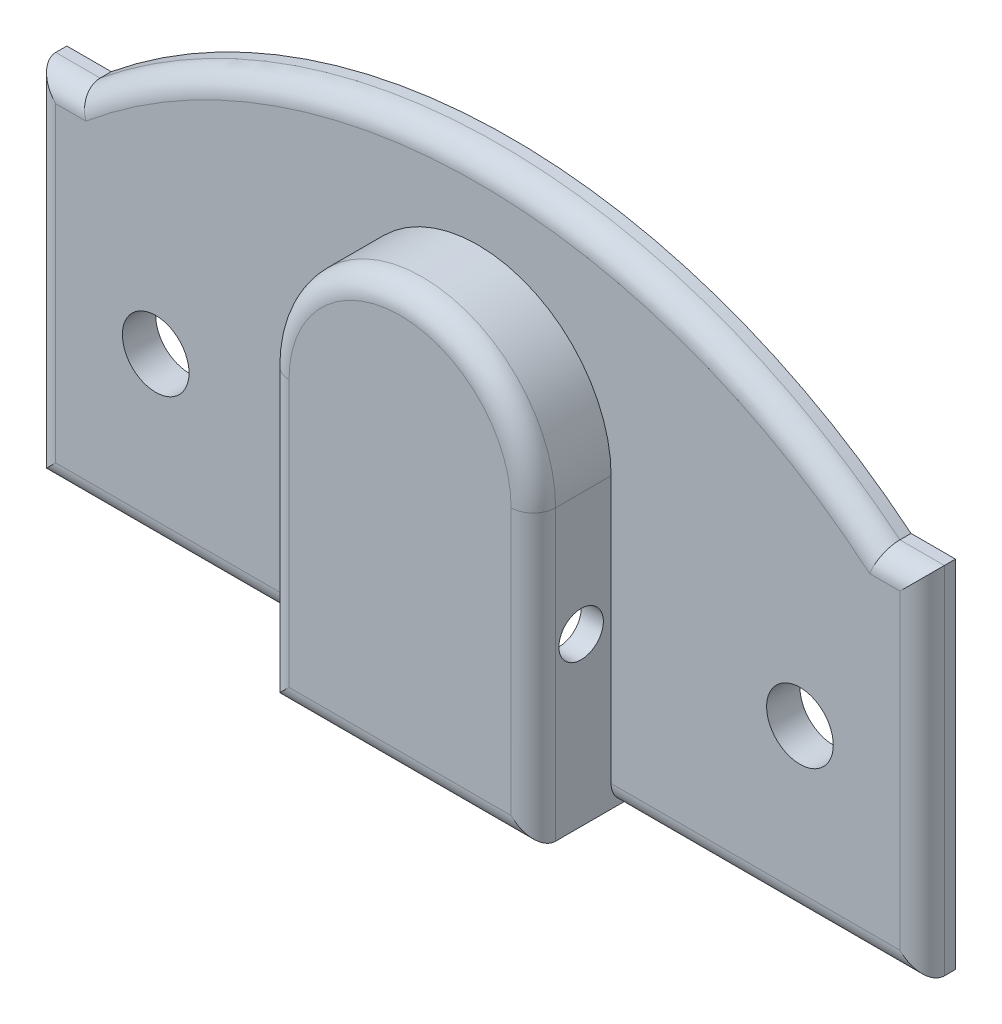
ISO-10303-21;
HEADER;
FILE_DESCRIPTION(('STEP AP214'),'2;1');
FILE_NAME('part.step','',(''),(''),'','','');
FILE_SCHEMA(('AUTOMOTIVE_DESIGN { 1 0 10303 214 1 1 1 1 }'));
ENDSEC;
DATA;
#1=APPLICATION_CONTEXT('core data for automotive mechanical design processes');
#2=APPLICATION_PROTOCOL_DEFINITION('international standard','automotive_design',2000,#1);
#3=PRODUCT_CONTEXT('',#1,'mechanical');
#4=PRODUCT('Part','Part','',(#3));
#5=PRODUCT_RELATED_PRODUCT_CATEGORY('part','',(#4));
#6=PRODUCT_DEFINITION_FORMATION('','',#4);
#7=PRODUCT_DEFINITION_CONTEXT('part definition',#1,'design');
#8=PRODUCT_DEFINITION('design','',#6,#7);
#9=PRODUCT_DEFINITION_SHAPE('','',#8);
#10=(LENGTH_UNIT() NAMED_UNIT(*) SI_UNIT(.MILLI.,.METRE.));
#11=(NAMED_UNIT(*) PLANE_ANGLE_UNIT() SI_UNIT($,.RADIAN.));
#12=(NAMED_UNIT(*) SI_UNIT($,.STERADIAN.) SOLID_ANGLE_UNIT());
#13=UNCERTAINTY_MEASURE_WITH_UNIT(LENGTH_MEASURE(1.E-05),#10,'distance_accuracy_value','');
#14=(GEOMETRIC_REPRESENTATION_CONTEXT(3) GLOBAL_UNCERTAINTY_ASSIGNED_CONTEXT((#13)) GLOBAL_UNIT_ASSIGNED_CONTEXT((#10,
#11,#12)) REPRESENTATION_CONTEXT('',''));
#15=CARTESIAN_POINT('',(0.,0.,0.));
#16=DIRECTION('',(0.,0.,1.));
#17=DIRECTION('',(1.,0.,0.));
#18=AXIS2_PLACEMENT_3D('',#15,#16,#17);
#19=CARTESIAN_POINT('',(0.,-6.07308128882335,0.));
#20=DIRECTION('',(0.,0.,-1.));
#21=DIRECTION('',(-1.,0.,0.));
#22=AXIS2_PLACEMENT_3D('',#19,#20,#21);
#23=PLANE('',#22);
#24=DIRECTION('',(1.,0.,0.));
#25=VECTOR('',#24,1.);
#26=CARTESIAN_POINT('',(0.,0.,0.));
#27=LINE('',#26,#25);
#28=CARTESIAN_POINT('',(5.,0.,0.));
#29=VERTEX_POINT('',#28);
#30=CARTESIAN_POINT('',(20.,0.,0.));
#31=VERTEX_POINT('',#30);
#32=EDGE_CURVE('E218',#29,#31,#27,.T.);
#33=ORIENTED_EDGE('',*,*,#32,.F.);
#34=DIRECTION('',(0.,1.,0.));
#35=VECTOR('',#34,1.);
#36=CARTESIAN_POINT('',(5.,0.,0.));
#37=LINE('',#36,#35);
#38=CARTESIAN_POINT('',(5.,12.,0.));
#39=VERTEX_POINT('',#38);
#40=EDGE_CURVE('E288',#29,#39,#37,.T.);
#41=ORIENTED_EDGE('',*,*,#40,.T.);
#42=CARTESIAN_POINT('',(0.,12.,0.));
#43=DIRECTION('',(0.,0.,1.));
#44=DIRECTION('',(1.,0.,0.));
#45=AXIS2_PLACEMENT_3D('',#42,#43,#44);
#46=CIRCLE('',#45,5.);
#47=CARTESIAN_POINT('',(-5.,12.,0.));
#48=VERTEX_POINT('',#47);
#49=EDGE_CURVE('E201',#39,#48,#46,.T.);
#50=ORIENTED_EDGE('',*,*,#49,.T.);
#51=DIRECTION('',(0.,1.,0.));
#52=VECTOR('',#51,1.);
#53=CARTESIAN_POINT('',(-5.,0.,0.));
#54=LINE('',#53,#52);
#55=CARTESIAN_POINT('',(-5.,0.,0.));
#56=VERTEX_POINT('',#55);
#57=EDGE_CURVE('E197',#56,#48,#54,.T.);
#58=ORIENTED_EDGE('',*,*,#57,.F.);
#59=CARTESIAN_POINT('',(-20.,0.,0.));
#60=VERTEX_POINT('',#59);
#61=EDGE_CURVE('E226',#60,#56,#27,.T.);
#62=ORIENTED_EDGE('',*,*,#61,.F.);
#63=DIRECTION('',(0.,-1.,0.));
#64=VECTOR('',#63,1.);
#65=CARTESIAN_POINT('',(-20.,16.,0.));
#66=LINE('',#65,#64);
#67=CARTESIAN_POINT('',(-20.,16.,0.));
#68=VERTEX_POINT('',#67);
#69=EDGE_CURVE('E241',#68,#60,#66,.T.);
#70=ORIENTED_EDGE('',*,*,#69,.F.);
#71=DIRECTION('',(-1.,0.,0.));
#72=VECTOR('',#71,1.);
#73=CARTESIAN_POINT('',(-20.,16.,0.));
#74=LINE('',#73,#72);
#75=CARTESIAN_POINT('',(-18.,16.,0.));
#76=VERTEX_POINT('',#75);
#77=EDGE_CURVE('E238',#76,#68,#74,.T.);
#78=ORIENTED_EDGE('',*,*,#77,.F.);
#79=CARTESIAN_POINT('',(0.,-6.07308128882335,0.));
#80=DIRECTION('',(0.,0.,1.));
#81=DIRECTION('',(-1.,0.,0.));
#82=AXIS2_PLACEMENT_3D('',#79,#80,#81);
#83=CIRCLE('',#82,28.4819402004674);
#84=CARTESIAN_POINT('',(18.,16.,0.));
#85=VERTEX_POINT('',#84);
#86=EDGE_CURVE('E235',#85,#76,#83,.T.);
#87=ORIENTED_EDGE('',*,*,#86,.F.);
#88=DIRECTION('',(-1.,0.,0.));
#89=VECTOR('',#88,1.);
#90=CARTESIAN_POINT('',(20.,16.,0.));
#91=LINE('',#90,#89);
#92=CARTESIAN_POINT('',(20.,16.,0.));
#93=VERTEX_POINT('',#92);
#94=EDGE_CURVE('E232',#93,#85,#91,.T.);
#95=ORIENTED_EDGE('',*,*,#94,.F.);
#96=DIRECTION('',(0.,1.,0.));
#97=VECTOR('',#96,1.);
#98=CARTESIAN_POINT('',(20.,0.,0.));
#99=LINE('',#98,#97);
#100=EDGE_CURVE('E229',#31,#93,#99,.T.);
#101=ORIENTED_EDGE('',*,*,#100,.F.);
#102=EDGE_LOOP('',(#33,#41,#50,#58,#62,#70,#78,#87,#95,#101));
#103=FACE_BOUND('',#102,.T.);
#104=CARTESIAN_POINT('',(-14.4995957691845,7.5,0.));
#105=DIRECTION('',(0.,0.,-1.));
#106=DIRECTION('',(-1.,0.,0.));
#107=AXIS2_PLACEMENT_3D('',#104,#105,#106);
#108=CIRCLE('',#107,1.5);
#109=CARTESIAN_POINT('',(-15.9995957691845,7.5,0.));
#110=VERTEX_POINT('',#109);
#111=EDGE_CURVE('E497',#110,#110,#108,.T.);
#112=ORIENTED_EDGE('',*,*,#111,.F.);
#113=EDGE_LOOP('',(#112));
#114=FACE_BOUND('',#113,.T.);
#115=CARTESIAN_POINT('',(14.4995957691845,7.5,0.));
#116=DIRECTION('',(0.,0.,-1.));
#117=DIRECTION('',(-1.,0.,0.));
#118=AXIS2_PLACEMENT_3D('',#115,#116,#117);
#119=CIRCLE('',#118,1.5);
#120=CARTESIAN_POINT('',(12.9995957691845,7.5,0.));
#121=VERTEX_POINT('',#120);
#122=EDGE_CURVE('E320',#121,#121,#119,.F.);
#123=ORIENTED_EDGE('',*,*,#122,.T.);
#124=EDGE_LOOP('',(#123));
#125=FACE_BOUND('',#124,.T.);
#126=ADVANCED_FACE('F38',(#103,#114,#125),#23,.T.);
#127=CARTESIAN_POINT('',(0.,-6.07308128882335,1.5));
#128=DIRECTION('',(0.,0.,-1.));
#129=DIRECTION('',(-1.,0.,0.));
#130=AXIS2_PLACEMENT_3D('',#127,#128,#129);
#131=PLANE('',#130);
#132=CARTESIAN_POINT('',(-14.4995957691845,7.5,1.5));
#133=DIRECTION('',(0.,0.,1.));
#134=DIRECTION('',(1.,0.,0.));
#135=AXIS2_PLACEMENT_3D('',#132,#133,#134);
#136=CIRCLE('',#135,1.5);
#137=CARTESIAN_POINT('',(-12.9995957691845,7.5,1.5));
#138=VERTEX_POINT('',#137);
#139=EDGE_CURVE('E501',#138,#138,#136,.T.);
#140=ORIENTED_EDGE('',*,*,#139,.F.);
#141=EDGE_LOOP('',(#140));
#142=FACE_BOUND('',#141,.T.);
#143=DIRECTION('',(0.,1.,0.));
#144=VECTOR('',#143,1.);
#145=CARTESIAN_POINT('',(6.,0.,1.5));
#146=LINE('',#145,#144);
#147=CARTESIAN_POINT('',(6.,1.,1.5));
#148=VERTEX_POINT('',#147);
#149=CARTESIAN_POINT('',(6.,13.,1.5));
#150=VERTEX_POINT('',#149);
#151=EDGE_CURVE('E213',#148,#150,#146,.T.);
#152=ORIENTED_EDGE('',*,*,#151,.F.);
#153=DIRECTION('',(1.,0.,0.));
#154=VECTOR('',#153,1.);
#155=CARTESIAN_POINT('',(0.,1.,1.5));
#156=LINE('',#155,#154);
#157=CARTESIAN_POINT('',(19.,1.,1.5));
#158=VERTEX_POINT('',#157);
#159=EDGE_CURVE('E300',#148,#158,#156,.T.);
#160=ORIENTED_EDGE('',*,*,#159,.T.);
#161=DIRECTION('',(0.,1.,0.));
#162=VECTOR('',#161,1.);
#163=CARTESIAN_POINT('',(19.,-6.07308128882335,1.5));
#164=LINE('',#163,#162);
#165=CARTESIAN_POINT('',(19.,15.,1.5));
#166=VERTEX_POINT('',#165);
#167=EDGE_CURVE('E298',#158,#166,#164,.T.);
#168=ORIENTED_EDGE('',*,*,#167,.T.);
#169=DIRECTION('',(-1.,0.,0.));
#170=VECTOR('',#169,1.);
#171=CARTESIAN_POINT('',(0.,15.,1.5));
#172=LINE('',#171,#170);
#173=CARTESIAN_POINT('',(17.6403594684664,15.,1.5));
#174=VERTEX_POINT('',#173);
#175=EDGE_CURVE('E296',#166,#174,#172,.T.);
#176=ORIENTED_EDGE('',*,*,#175,.T.);
#177=CARTESIAN_POINT('',(0.,-6.07308128882335,1.5));
#178=DIRECTION('',(0.,0.,-1.));
#179=DIRECTION('',(-1.,0.,0.));
#180=AXIS2_PLACEMENT_3D('',#177,#178,#179);
#181=CIRCLE('',#180,27.4819402004674);
#182=CARTESIAN_POINT('',(-17.6403594684664,15.,1.5));
#183=VERTEX_POINT('',#182);
#184=EDGE_CURVE('E292',#174,#183,#181,.F.);
#185=ORIENTED_EDGE('',*,*,#184,.T.);
#186=DIRECTION('',(-1.,0.,0.));
#187=VECTOR('',#186,1.);
#188=CARTESIAN_POINT('',(0.,15.,1.5));
#189=LINE('',#188,#187);
#190=CARTESIAN_POINT('',(-19.,15.,1.5));
#191=VERTEX_POINT('',#190);
#192=EDGE_CURVE('E290',#183,#191,#189,.T.);
#193=ORIENTED_EDGE('',*,*,#192,.T.);
#194=DIRECTION('',(0.,-1.,0.));
#195=VECTOR('',#194,1.);
#196=CARTESIAN_POINT('',(-19.,-6.07308128882335,1.5));
#197=LINE('',#196,#195);
#198=CARTESIAN_POINT('',(-19.,1.,1.5));
#199=VERTEX_POINT('',#198);
#200=EDGE_CURVE('E276',#191,#199,#197,.T.);
#201=ORIENTED_EDGE('',*,*,#200,.T.);
#202=DIRECTION('',(1.,0.,0.));
#203=VECTOR('',#202,1.);
#204=CARTESIAN_POINT('',(0.,1.,1.5));
#205=LINE('',#204,#203);
#206=CARTESIAN_POINT('',(-6.,1.,1.5));
#207=VERTEX_POINT('',#206);
#208=EDGE_CURVE('E294',#199,#207,#205,.T.);
#209=ORIENTED_EDGE('',*,*,#208,.T.);
#210=DIRECTION('',(0.,1.,0.));
#211=VECTOR('',#210,1.);
#212=CARTESIAN_POINT('',(-6.,0.,1.5));
#213=LINE('',#212,#211);
#214=CARTESIAN_POINT('',(-6.,13.,1.5));
#215=VERTEX_POINT('',#214);
#216=EDGE_CURVE('E202',#207,#215,#213,.T.);
#217=ORIENTED_EDGE('',*,*,#216,.T.);
#218=CARTESIAN_POINT('',(0.,13.,1.5));
#219=DIRECTION('',(0.,0.,-1.));
#220=DIRECTION('',(-1.,0.,0.));
#221=AXIS2_PLACEMENT_3D('',#218,#219,#220);
#222=CIRCLE('',#221,6.);
#223=EDGE_CURVE('E205',#215,#150,#222,.T.);
#224=ORIENTED_EDGE('',*,*,#223,.T.);
#225=EDGE_LOOP('',(#152,#160,#168,#176,#185,#193,#201,#209,#217,#224));
#226=FACE_BOUND('',#225,.T.);
#227=CARTESIAN_POINT('',(14.4995957691845,7.5,1.5));
#228=DIRECTION('',(0.,0.,1.));
#229=DIRECTION('',(1.,0.,0.));
#230=AXIS2_PLACEMENT_3D('',#227,#228,#229);
#231=CIRCLE('',#230,1.5);
#232=CARTESIAN_POINT('',(15.9995957691845,7.5,1.5));
#233=VERTEX_POINT('',#232);
#234=EDGE_CURVE('E500',#233,#233,#231,.F.);
#235=ORIENTED_EDGE('',*,*,#234,.T.);
#236=EDGE_LOOP('',(#235));
#237=FACE_BOUND('',#236,.T.);
#238=ADVANCED_FACE('F361',(#142,#226,#237),#131,.F.);
#239=CARTESIAN_POINT('',(0.,0.,1.5));
#240=DIRECTION('',(0.,1.,0.));
#241=DIRECTION('',(0.,0.,1.));
#242=AXIS2_PLACEMENT_3D('',#239,#240,#241);
#243=PLANE('',#242);
#244=DIRECTION('',(0.,0.,-1.));
#245=VECTOR('',#244,1.);
#246=CARTESIAN_POINT('',(20.,0.,1.5));
#247=LINE('',#246,#245);
#248=CARTESIAN_POINT('',(20.,0.,0.5));
#249=VERTEX_POINT('',#248);
#250=EDGE_CURVE('E254',#249,#31,#247,.T.);
#251=ORIENTED_EDGE('',*,*,#250,.F.);
#252=DIRECTION('',(1.,0.,0.));
#253=VECTOR('',#252,1.);
#254=CARTESIAN_POINT('',(0.,0.,0.5));
#255=LINE('',#254,#253);
#256=CARTESIAN_POINT('',(6.,0.,0.5));
#257=VERTEX_POINT('',#256);
#258=EDGE_CURVE('E303',#249,#257,#255,.F.);
#259=ORIENTED_EDGE('',*,*,#258,.T.);
#260=DIRECTION('',(0.,0.,-1.));
#261=VECTOR('',#260,1.);
#262=CARTESIAN_POINT('',(6.,0.,5.));
#263=LINE('',#262,#261);
#264=CARTESIAN_POINT('',(6.,0.,4.));
#265=VERTEX_POINT('',#264);
#266=EDGE_CURVE('E219',#265,#257,#263,.T.);
#267=ORIENTED_EDGE('',*,*,#266,.F.);
#268=DIRECTION('',(1.,0.,0.));
#269=VECTOR('',#268,1.);
#270=CARTESIAN_POINT('',(0.,0.,4.));
#271=LINE('',#270,#269);
#272=CARTESIAN_POINT('',(5.,0.,4.));
#273=VERTEX_POINT('',#272);
#274=EDGE_CURVE('E272',#265,#273,#271,.F.);
#275=ORIENTED_EDGE('',*,*,#274,.T.);
#276=DIRECTION('',(0.,0.,-1.));
#277=VECTOR('',#276,1.);
#278=CARTESIAN_POINT('',(5.,0.,4.));
#279=LINE('',#278,#277);
#280=EDGE_CURVE('E196',#273,#29,#279,.T.);
#281=ORIENTED_EDGE('',*,*,#280,.T.);
#282=ORIENTED_EDGE('',*,*,#32,.T.);
#283=EDGE_LOOP('',(#251,#259,#267,#275,#281,#282));
#284=FACE_BOUND('',#283,.T.);
#285=ADVANCED_FACE('F367',(#284),#243,.F.);
#286=DIRECTION('',(0.,0.,-1.));
#287=VECTOR('',#286,1.);
#288=CARTESIAN_POINT('',(-6.,0.,5.));
#289=LINE('',#288,#287);
#290=CARTESIAN_POINT('',(-6.,0.,4.));
#291=VERTEX_POINT('',#290);
#292=CARTESIAN_POINT('',(-6.,0.,0.5));
#293=VERTEX_POINT('',#292);
#294=EDGE_CURVE('E216',#291,#293,#289,.T.);
#295=ORIENTED_EDGE('',*,*,#294,.T.);
#296=DIRECTION('',(1.,0.,0.));
#297=VECTOR('',#296,1.);
#298=CARTESIAN_POINT('',(0.,0.,0.5));
#299=LINE('',#298,#297);
#300=CARTESIAN_POINT('',(-20.,0.,0.5));
#301=VERTEX_POINT('',#300);
#302=EDGE_CURVE('E310',#293,#301,#299,.F.);
#303=ORIENTED_EDGE('',*,*,#302,.T.);
#304=DIRECTION('',(0.,0.,-1.));
#305=VECTOR('',#304,1.);
#306=CARTESIAN_POINT('',(-20.,0.,1.5));
#307=LINE('',#306,#305);
#308=EDGE_CURVE('E244',#301,#60,#307,.T.);
#309=ORIENTED_EDGE('',*,*,#308,.T.);
#310=ORIENTED_EDGE('',*,*,#61,.T.);
#311=DIRECTION('',(0.,0.,-1.));
#312=VECTOR('',#311,1.);
#313=CARTESIAN_POINT('',(-5.,0.,4.));
#314=LINE('',#313,#312);
#315=CARTESIAN_POINT('',(-5.,0.,4.));
#316=VERTEX_POINT('',#315);
#317=EDGE_CURVE('E207',#316,#56,#314,.T.);
#318=ORIENTED_EDGE('',*,*,#317,.F.);
#319=DIRECTION('',(1.,0.,0.));
#320=VECTOR('',#319,1.);
#321=CARTESIAN_POINT('',(0.,0.,4.));
#322=LINE('',#321,#320);
#323=EDGE_CURVE('E270',#316,#291,#322,.F.);
#324=ORIENTED_EDGE('',*,*,#323,.T.);
#325=EDGE_LOOP('',(#295,#303,#309,#310,#318,#324));
#326=FACE_BOUND('',#325,.T.);
#327=ADVANCED_FACE('F392',(#326),#243,.F.);
#328=CARTESIAN_POINT('',(20.,0.,1.5));
#329=DIRECTION('',(-1.,0.,0.));
#330=DIRECTION('',(0.,0.,1.));
#331=AXIS2_PLACEMENT_3D('',#328,#329,#330);
#332=PLANE('',#331);
#333=DIRECTION('',(0.,0.,-1.));
#334=VECTOR('',#333,1.);
#335=CARTESIAN_POINT('',(20.,16.,1.5));
#336=LINE('',#335,#334);
#337=CARTESIAN_POINT('',(20.,16.,0.5));
#338=VERTEX_POINT('',#337);
#339=EDGE_CURVE('E252',#338,#93,#336,.T.);
#340=ORIENTED_EDGE('',*,*,#339,.F.);
#341=DIRECTION('',(0.,1.,0.));
#342=VECTOR('',#341,1.);
#343=CARTESIAN_POINT('',(20.,0.,0.5));
#344=LINE('',#343,#342);
#345=EDGE_CURVE('E306',#338,#249,#344,.F.);
#346=ORIENTED_EDGE('',*,*,#345,.T.);
#347=ORIENTED_EDGE('',*,*,#250,.T.);
#348=ORIENTED_EDGE('',*,*,#100,.T.);
#349=EDGE_LOOP('',(#340,#346,#347,#348));
#350=FACE_BOUND('',#349,.T.);
#351=ADVANCED_FACE('F388',(#350),#332,.F.);
#352=CARTESIAN_POINT('',(20.,16.,1.5));
#353=DIRECTION('',(0.,-1.,0.));
#354=DIRECTION('',(1.,0.,0.));
#355=AXIS2_PLACEMENT_3D('',#352,#353,#354);
#356=PLANE('',#355);
#357=DIRECTION('',(0.,0.,-1.));
#358=VECTOR('',#357,1.);
#359=CARTESIAN_POINT('',(18.,16.,1.5));
#360=LINE('',#359,#358);
#361=CARTESIAN_POINT('',(18.,16.,0.5));
#362=VERTEX_POINT('',#361);
#363=EDGE_CURVE('E250',#362,#85,#360,.T.);
#364=ORIENTED_EDGE('',*,*,#363,.F.);
#365=DIRECTION('',(-1.,0.,0.));
#366=VECTOR('',#365,1.);
#367=CARTESIAN_POINT('',(20.,16.,0.5));
#368=LINE('',#367,#366);
#369=EDGE_CURVE('E308',#362,#338,#368,.F.);
#370=ORIENTED_EDGE('',*,*,#369,.T.);
#371=ORIENTED_EDGE('',*,*,#339,.T.);
#372=ORIENTED_EDGE('',*,*,#94,.T.);
#373=EDGE_LOOP('',(#364,#370,#371,#372));
#374=FACE_BOUND('',#373,.T.);
#375=ADVANCED_FACE('F384',(#374),#356,.F.);
#376=CARTESIAN_POINT('',(0.,-6.07308128882335,1.5));
#377=DIRECTION('',(0.,0.,-1.));
#378=DIRECTION('',(-1.,0.,0.));
#379=AXIS2_PLACEMENT_3D('',#376,#377,#378);
#380=CYLINDRICAL_SURFACE('',#379,28.4819402004674);
#381=DIRECTION('',(0.,0.,-1.));
#382=VECTOR('',#381,1.);
#383=CARTESIAN_POINT('',(-18.,16.,1.5));
#384=LINE('',#383,#382);
#385=CARTESIAN_POINT('',(-18.,16.,0.5));
#386=VERTEX_POINT('',#385);
#387=EDGE_CURVE('E248',#386,#76,#384,.T.);
#388=ORIENTED_EDGE('',*,*,#387,.F.);
#389=CARTESIAN_POINT('',(0.,-6.07308128882335,0.5));
#390=DIRECTION('',(0.,0.,-1.));
#391=DIRECTION('',(-1.,0.,0.));
#392=AXIS2_PLACEMENT_3D('',#389,#390,#391);
#393=CIRCLE('',#392,28.4819402004674);
#394=EDGE_CURVE('E312',#386,#362,#393,.T.);
#395=ORIENTED_EDGE('',*,*,#394,.T.);
#396=ORIENTED_EDGE('',*,*,#363,.T.);
#397=ORIENTED_EDGE('',*,*,#86,.T.);
#398=EDGE_LOOP('',(#388,#395,#396,#397));
#399=FACE_BOUND('',#398,.T.);
#400=ADVANCED_FACE('F381',(#399),#380,.T.);
#401=CARTESIAN_POINT('',(-20.,16.,1.5));
#402=DIRECTION('',(0.,-1.,0.));
#403=DIRECTION('',(0.,0.,-1.));
#404=AXIS2_PLACEMENT_3D('',#401,#402,#403);
#405=PLANE('',#404);
#406=DIRECTION('',(0.,0.,-1.));
#407=VECTOR('',#406,1.);
#408=CARTESIAN_POINT('',(-20.,16.,1.5));
#409=LINE('',#408,#407);
#410=CARTESIAN_POINT('',(-20.,16.,0.5));
#411=VERTEX_POINT('',#410);
#412=EDGE_CURVE('E246',#411,#68,#409,.T.);
#413=ORIENTED_EDGE('',*,*,#412,.F.);
#414=DIRECTION('',(-1.,0.,0.));
#415=VECTOR('',#414,1.);
#416=CARTESIAN_POINT('',(-20.,16.,0.5));
#417=LINE('',#416,#415);
#418=EDGE_CURVE('E62',#411,#386,#417,.F.);
#419=ORIENTED_EDGE('',*,*,#418,.T.);
#420=ORIENTED_EDGE('',*,*,#387,.T.);
#421=ORIENTED_EDGE('',*,*,#77,.T.);
#422=EDGE_LOOP('',(#413,#419,#420,#421));
#423=FACE_BOUND('',#422,.T.);
#424=ADVANCED_FACE('F378',(#423),#405,.F.);
#425=CARTESIAN_POINT('',(-20.,16.,1.5));
#426=DIRECTION('',(1.,0.,0.));
#427=DIRECTION('',(0.,1.,0.));
#428=AXIS2_PLACEMENT_3D('',#425,#426,#427);
#429=PLANE('',#428);
#430=ORIENTED_EDGE('',*,*,#308,.F.);
#431=DIRECTION('',(0.,-1.,0.));
#432=VECTOR('',#431,1.);
#433=CARTESIAN_POINT('',(-20.,16.,0.5));
#434=LINE('',#433,#432);
#435=EDGE_CURVE('E55',#301,#411,#434,.F.);
#436=ORIENTED_EDGE('',*,*,#435,.T.);
#437=ORIENTED_EDGE('',*,*,#412,.T.);
#438=ORIENTED_EDGE('',*,*,#69,.T.);
#439=EDGE_LOOP('',(#430,#436,#437,#438));
#440=FACE_BOUND('',#439,.T.);
#441=ADVANCED_FACE('F374',(#440),#429,.F.);
#442=CARTESIAN_POINT('',(-6.,0.,5.));
#443=DIRECTION('',(-1.,0.,0.));
#444=DIRECTION('',(0.,0.,1.));
#445=AXIS2_PLACEMENT_3D('',#442,#443,#444);
#446=PLANE('',#445);
#447=CARTESIAN_POINT('',(-6.,7.5,2.85));
#448=DIRECTION('',(-1.,0.,0.));
#449=DIRECTION('',(0.,0.,1.));
#450=AXIS2_PLACEMENT_3D('',#447,#448,#449);
#451=CIRCLE('',#450,1.);
#452=CARTESIAN_POINT('',(-6.,7.5,3.85));
#453=VERTEX_POINT('',#452);
#454=EDGE_CURVE('E512',#453,#453,#451,.T.);
#455=ORIENTED_EDGE('',*,*,#454,.F.);
#456=EDGE_LOOP('',(#455));
#457=FACE_BOUND('',#456,.T.);
#458=ORIENTED_EDGE('',*,*,#294,.F.);
#459=DIRECTION('',(0.,1.,0.));
#460=VECTOR('',#459,1.);
#461=CARTESIAN_POINT('',(-6.,13.,4.));
#462=LINE('',#461,#460);
#463=CARTESIAN_POINT('',(-6.,13.,4.));
#464=VERTEX_POINT('',#463);
#465=EDGE_CURVE('E274',#291,#464,#462,.T.);
#466=ORIENTED_EDGE('',*,*,#465,.T.);
#467=DIRECTION('',(0.,0.,-1.));
#468=VECTOR('',#467,1.);
#469=CARTESIAN_POINT('',(-6.,13.,5.));
#470=LINE('',#469,#468);
#471=EDGE_CURVE('E215',#464,#215,#470,.T.);
#472=ORIENTED_EDGE('',*,*,#471,.T.);
#473=ORIENTED_EDGE('',*,*,#216,.F.);
#474=CARTESIAN_POINT('',(-6.,1.,0.5));
#475=DIRECTION('',(-1.,0.,0.));
#476=DIRECTION('',(0.,0.,1.));
#477=AXIS2_PLACEMENT_3D('',#474,#475,#476);
#478=CIRCLE('',#477,1.);
#479=EDGE_CURVE('E11',#207,#293,#478,.F.);
#480=ORIENTED_EDGE('',*,*,#479,.T.);
#481=EDGE_LOOP('',(#458,#466,#472,#473,#480));
#482=FACE_BOUND('',#481,.T.);
#483=ADVANCED_FACE('F377',(#457,#482),#446,.T.);
#484=CARTESIAN_POINT('',(6.,0.,5.));
#485=DIRECTION('',(-1.,0.,0.));
#486=DIRECTION('',(0.,0.,1.));
#487=AXIS2_PLACEMENT_3D('',#484,#485,#486);
#488=PLANE('',#487);
#489=CARTESIAN_POINT('',(6.,7.5,2.85));
#490=DIRECTION('',(-1.,0.,0.));
#491=DIRECTION('',(0.,0.,1.));
#492=AXIS2_PLACEMENT_3D('',#489,#490,#491);
#493=CIRCLE('',#492,1.);
#494=CARTESIAN_POINT('',(6.,7.5,3.85));
#495=VERTEX_POINT('',#494);
#496=EDGE_CURVE('E504',#495,#495,#493,.T.);
#497=ORIENTED_EDGE('',*,*,#496,.T.);
#498=EDGE_LOOP('',(#497));
#499=FACE_BOUND('',#498,.T.);
#500=DIRECTION('',(0.,0.,-1.));
#501=VECTOR('',#500,1.);
#502=CARTESIAN_POINT('',(6.,13.,5.));
#503=LINE('',#502,#501);
#504=CARTESIAN_POINT('',(6.,13.,4.));
#505=VERTEX_POINT('',#504);
#506=EDGE_CURVE('E221',#505,#150,#503,.T.);
#507=ORIENTED_EDGE('',*,*,#506,.F.);
#508=DIRECTION('',(0.,1.,0.));
#509=VECTOR('',#508,1.);
#510=CARTESIAN_POINT('',(6.,0.,4.));
#511=LINE('',#510,#509);
#512=EDGE_CURVE('E268',#505,#265,#511,.F.);
#513=ORIENTED_EDGE('',*,*,#512,.T.);
#514=ORIENTED_EDGE('',*,*,#266,.T.);
#515=CARTESIAN_POINT('',(6.,1.,0.5));
#516=DIRECTION('',(-1.,0.,0.));
#517=DIRECTION('',(0.,0.,1.));
#518=AXIS2_PLACEMENT_3D('',#515,#516,#517);
#519=CIRCLE('',#518,1.);
#520=EDGE_CURVE('E47',#257,#148,#519,.T.);
#521=ORIENTED_EDGE('',*,*,#520,.T.);
#522=ORIENTED_EDGE('',*,*,#151,.T.);
#523=EDGE_LOOP('',(#507,#513,#514,#521,#522));
#524=FACE_BOUND('',#523,.T.);
#525=ADVANCED_FACE('F482',(#499,#524),#488,.F.);
#526=CARTESIAN_POINT('',(0.,13.,5.));
#527=DIRECTION('',(0.,0.,-1.));
#528=DIRECTION('',(-1.,0.,0.));
#529=AXIS2_PLACEMENT_3D('',#526,#527,#528);
#530=CYLINDRICAL_SURFACE('',#529,6.);
#531=ORIENTED_EDGE('',*,*,#471,.F.);
#532=CARTESIAN_POINT('',(0.,13.,4.));
#533=DIRECTION('',(0.,0.,-1.));
#534=DIRECTION('',(-1.,0.,0.));
#535=AXIS2_PLACEMENT_3D('',#532,#533,#534);
#536=CIRCLE('',#535,6.);
#537=EDGE_CURVE('E256',#464,#505,#536,.T.);
#538=ORIENTED_EDGE('',*,*,#537,.T.);
#539=ORIENTED_EDGE('',*,*,#506,.T.);
#540=ORIENTED_EDGE('',*,*,#223,.F.);
#541=EDGE_LOOP('',(#531,#538,#539,#540));
#542=FACE_BOUND('',#541,.T.);
#543=ADVANCED_FACE('F452',(#542),#530,.T.);
#544=CARTESIAN_POINT('',(0.,13.,5.));
#545=DIRECTION('',(0.,0.,-1.));
#546=DIRECTION('',(-1.,0.,0.));
#547=AXIS2_PLACEMENT_3D('',#544,#545,#546);
#548=PLANE('',#547);
#549=DIRECTION('',(0.,1.,0.));
#550=VECTOR('',#549,1.);
#551=CARTESIAN_POINT('',(5.,13.,5.));
#552=LINE('',#551,#550);
#553=CARTESIAN_POINT('',(5.,0.999999999999999,5.));
#554=VERTEX_POINT('',#553);
#555=CARTESIAN_POINT('',(5.,13.,5.));
#556=VERTEX_POINT('',#555);
#557=EDGE_CURVE('E263',#554,#556,#552,.T.);
#558=ORIENTED_EDGE('',*,*,#557,.T.);
#559=CARTESIAN_POINT('',(0.,13.,5.));
#560=DIRECTION('',(0.,0.,-1.));
#561=DIRECTION('',(-1.,0.,0.));
#562=AXIS2_PLACEMENT_3D('',#559,#560,#561);
#563=CIRCLE('',#562,5.);
#564=CARTESIAN_POINT('',(-5.,13.,5.));
#565=VERTEX_POINT('',#564);
#566=EDGE_CURVE('E265',#556,#565,#563,.F.);
#567=ORIENTED_EDGE('',*,*,#566,.T.);
#568=DIRECTION('',(0.,1.,0.));
#569=VECTOR('',#568,1.);
#570=CARTESIAN_POINT('',(-5.,0.,5.));
#571=LINE('',#570,#569);
#572=CARTESIAN_POINT('',(-5.,0.999999999999999,5.));
#573=VERTEX_POINT('',#572);
#574=EDGE_CURVE('E259',#565,#573,#571,.F.);
#575=ORIENTED_EDGE('',*,*,#574,.T.);
#576=DIRECTION('',(1.,0.,0.));
#577=VECTOR('',#576,1.);
#578=CARTESIAN_POINT('',(0.,0.999999999999999,5.));
#579=LINE('',#578,#577);
#580=EDGE_CURVE('E261',#573,#554,#579,.T.);
#581=ORIENTED_EDGE('',*,*,#580,.T.);
#582=EDGE_LOOP('',(#558,#567,#575,#581));
#583=FACE_BOUND('',#582,.T.);
#584=ADVANCED_FACE('F544',(#583),#548,.F.);
#585=CARTESIAN_POINT('',(5.,0.,4.));
#586=DIRECTION('',(-1.,0.,0.));
#587=DIRECTION('',(0.,0.,1.));
#588=AXIS2_PLACEMENT_3D('',#585,#586,#587);
#589=PLANE('',#588);
#590=CARTESIAN_POINT('',(5.,7.5,2.85));
#591=DIRECTION('',(-1.,0.,0.));
#592=DIRECTION('',(0.,0.,1.));
#593=AXIS2_PLACEMENT_3D('',#590,#591,#592);
#594=CIRCLE('',#593,1.);
#595=CARTESIAN_POINT('',(5.,7.5,3.85));
#596=VERTEX_POINT('',#595);
#597=EDGE_CURVE('E509',#596,#596,#594,.T.);
#598=ORIENTED_EDGE('',*,*,#597,.F.);
#599=EDGE_LOOP('',(#598));
#600=FACE_BOUND('',#599,.T.);
#601=ORIENTED_EDGE('',*,*,#40,.F.);
#602=ORIENTED_EDGE('',*,*,#280,.F.);
#603=DIRECTION('',(0.,1.,0.));
#604=VECTOR('',#603,1.);
#605=CARTESIAN_POINT('',(5.,0.,4.));
#606=LINE('',#605,#604);
#607=CARTESIAN_POINT('',(5.,12.,4.));
#608=VERTEX_POINT('',#607);
#609=EDGE_CURVE('E182',#273,#608,#606,.T.);
#610=ORIENTED_EDGE('',*,*,#609,.T.);
#611=DIRECTION('',(0.,0.,-1.));
#612=VECTOR('',#611,1.);
#613=CARTESIAN_POINT('',(5.,12.,4.));
#614=LINE('',#613,#612);
#615=EDGE_CURVE('E193',#608,#39,#614,.T.);
#616=ORIENTED_EDGE('',*,*,#615,.T.);
#617=EDGE_LOOP('',(#601,#602,#610,#616));
#618=FACE_BOUND('',#617,.T.);
#619=ADVANCED_FACE('F192',(#600,#618),#589,.T.);
#620=CARTESIAN_POINT('',(0.,12.,4.));
#621=DIRECTION('',(0.,0.,-1.));
#622=DIRECTION('',(-1.,0.,0.));
#623=AXIS2_PLACEMENT_3D('',#620,#621,#622);
#624=CYLINDRICAL_SURFACE('',#623,5.);
#625=ORIENTED_EDGE('',*,*,#49,.F.);
#626=ORIENTED_EDGE('',*,*,#615,.F.);
#627=CARTESIAN_POINT('',(0.,12.,4.));
#628=DIRECTION('',(0.,0.,1.));
#629=DIRECTION('',(1.,0.,0.));
#630=AXIS2_PLACEMENT_3D('',#627,#628,#629);
#631=CIRCLE('',#630,5.);
#632=CARTESIAN_POINT('',(-5.,12.,4.));
#633=VERTEX_POINT('',#632);
#634=EDGE_CURVE('E178',#608,#633,#631,.T.);
#635=ORIENTED_EDGE('',*,*,#634,.T.);
#636=DIRECTION('',(0.,0.,-1.));
#637=VECTOR('',#636,1.);
#638=CARTESIAN_POINT('',(-5.,12.,4.));
#639=LINE('',#638,#637);
#640=EDGE_CURVE('E203',#633,#48,#639,.T.);
#641=ORIENTED_EDGE('',*,*,#640,.T.);
#642=EDGE_LOOP('',(#625,#626,#635,#641));
#643=FACE_BOUND('',#642,.T.);
#644=ADVANCED_FACE('F199',(#643),#624,.F.);
#645=CARTESIAN_POINT('',(-5.,0.,4.));
#646=DIRECTION('',(-1.,0.,0.));
#647=DIRECTION('',(0.,0.,1.));
#648=AXIS2_PLACEMENT_3D('',#645,#646,#647);
#649=PLANE('',#648);
#650=CARTESIAN_POINT('',(-5.,7.5,2.85));
#651=DIRECTION('',(-1.,0.,0.));
#652=DIRECTION('',(0.,0.,1.));
#653=AXIS2_PLACEMENT_3D('',#650,#651,#652);
#654=CIRCLE('',#653,1.);
#655=CARTESIAN_POINT('',(-5.,7.5,3.85));
#656=VERTEX_POINT('',#655);
#657=EDGE_CURVE('E42',#656,#656,#654,.T.);
#658=ORIENTED_EDGE('',*,*,#657,.T.);
#659=EDGE_LOOP('',(#658));
#660=FACE_BOUND('',#659,.T.);
#661=ORIENTED_EDGE('',*,*,#57,.T.);
#662=ORIENTED_EDGE('',*,*,#640,.F.);
#663=DIRECTION('',(0.,1.,0.));
#664=VECTOR('',#663,1.);
#665=CARTESIAN_POINT('',(-5.,0.,4.));
#666=LINE('',#665,#664);
#667=EDGE_CURVE('E184',#316,#633,#666,.T.);
#668=ORIENTED_EDGE('',*,*,#667,.F.);
#669=ORIENTED_EDGE('',*,*,#317,.T.);
#670=EDGE_LOOP('',(#661,#662,#668,#669));
#671=FACE_BOUND('',#670,.T.);
#672=ADVANCED_FACE('F493',(#660,#671),#649,.F.);
#673=CARTESIAN_POINT('',(0.,12.,4.));
#674=DIRECTION('',(0.,0.,1.));
#675=DIRECTION('',(1.,0.,0.));
#676=AXIS2_PLACEMENT_3D('',#673,#674,#675);
#677=PLANE('',#676);
#678=ORIENTED_EDGE('',*,*,#609,.F.);
#679=DIRECTION('',(-1.,0.,0.));
#680=VECTOR('',#679,1.);
#681=CARTESIAN_POINT('',(0.,0.,4.));
#682=LINE('',#681,#680);
#683=EDGE_CURVE('E484',#273,#316,#682,.T.);
#684=ORIENTED_EDGE('',*,*,#683,.T.);
#685=ORIENTED_EDGE('',*,*,#667,.T.);
#686=ORIENTED_EDGE('',*,*,#634,.F.);
#687=EDGE_LOOP('',(#678,#684,#685,#686));
#688=FACE_BOUND('',#687,.T.);
#689=ADVANCED_FACE('F180',(#688),#677,.F.);
#690=CARTESIAN_POINT('',(0.,0.999999999999999,4.));
#691=DIRECTION('',(1.,0.,0.));
#692=DIRECTION('',(0.,0.,-1.));
#693=AXIS2_PLACEMENT_3D('',#690,#691,#692);
#694=CYLINDRICAL_SURFACE('',#693,1.);
#695=CARTESIAN_POINT('',(5.,0.999999999999999,4.));
#696=DIRECTION('',(0.707106781186547,0.707106781186547,0.));
#697=DIRECTION('',(0.707106781186547,-0.707106781186547,0.));
#698=AXIS2_PLACEMENT_3D('',#695,#696,#697);
#699=ELLIPSE('',#698,1.41421356237309,1.);
#700=EDGE_CURVE('E282',#554,#265,#699,.T.);
#701=ORIENTED_EDGE('',*,*,#700,.F.);
#702=ORIENTED_EDGE('',*,*,#580,.F.);
#703=CARTESIAN_POINT('',(-5.,0.999999999999999,4.));
#704=DIRECTION('',(0.707106781186547,-0.707106781186547,0.));
#705=DIRECTION('',(-0.707106781186547,-0.707106781186547,0.));
#706=AXIS2_PLACEMENT_3D('',#703,#704,#705);
#707=ELLIPSE('',#706,1.41421356237309,1.);
#708=EDGE_CURVE('E285',#291,#573,#707,.F.);
#709=ORIENTED_EDGE('',*,*,#708,.F.);
#710=ORIENTED_EDGE('',*,*,#323,.F.);
#711=ORIENTED_EDGE('',*,*,#683,.F.);
#712=ORIENTED_EDGE('',*,*,#274,.F.);
#713=EDGE_LOOP('',(#701,#702,#709,#710,#711,#712));
#714=FACE_BOUND('',#713,.T.);
#715=ADVANCED_FACE('F407',(#714),#694,.T.);
#716=CARTESIAN_POINT('',(-5.,0.,4.));
#717=DIRECTION('',(0.,-1.,0.));
#718=DIRECTION('',(0.,0.,-1.));
#719=AXIS2_PLACEMENT_3D('',#716,#717,#718);
#720=CYLINDRICAL_SURFACE('',#719,1.);
#721=ORIENTED_EDGE('',*,*,#708,.T.);
#722=ORIENTED_EDGE('',*,*,#574,.F.);
#723=CARTESIAN_POINT('',(-5.,13.,4.));
#724=DIRECTION('',(0.,1.,0.));
#725=DIRECTION('',(0.,0.,1.));
#726=AXIS2_PLACEMENT_3D('',#723,#724,#725);
#727=CIRCLE('',#726,1.);
#728=EDGE_CURVE('E279',#464,#565,#727,.T.);
#729=ORIENTED_EDGE('',*,*,#728,.F.);
#730=ORIENTED_EDGE('',*,*,#465,.F.);
#731=EDGE_LOOP('',(#721,#722,#729,#730));
#732=FACE_BOUND('',#731,.T.);
#733=ADVANCED_FACE('F403',(#732),#720,.T.);
#734=CARTESIAN_POINT('',(5.,13.,4.));
#735=DIRECTION('',(0.,1.,0.));
#736=DIRECTION('',(0.,0.,1.));
#737=AXIS2_PLACEMENT_3D('',#734,#735,#736);
#738=CYLINDRICAL_SURFACE('',#737,1.);
#739=ORIENTED_EDGE('',*,*,#700,.T.);
#740=ORIENTED_EDGE('',*,*,#512,.F.);
#741=CARTESIAN_POINT('',(5.,13.,4.));
#742=DIRECTION('',(0.,1.,0.));
#743=DIRECTION('',(0.,0.,1.));
#744=AXIS2_PLACEMENT_3D('',#741,#742,#743);
#745=CIRCLE('',#744,1.);
#746=EDGE_CURVE('E277',#556,#505,#745,.T.);
#747=ORIENTED_EDGE('',*,*,#746,.F.);
#748=ORIENTED_EDGE('',*,*,#557,.F.);
#749=EDGE_LOOP('',(#739,#740,#747,#748));
#750=FACE_BOUND('',#749,.T.);
#751=ADVANCED_FACE('F399',(#750),#738,.T.);
#752=CARTESIAN_POINT('',(0.,13.,4.));
#753=DIRECTION('',(0.,0.,-1.));
#754=DIRECTION('',(-1.,0.,0.));
#755=AXIS2_PLACEMENT_3D('',#752,#753,#754);
#756=TOROIDAL_SURFACE('',#755,5.,1.);
#757=ORIENTED_EDGE('',*,*,#728,.T.);
#758=ORIENTED_EDGE('',*,*,#566,.F.);
#759=ORIENTED_EDGE('',*,*,#746,.T.);
#760=ORIENTED_EDGE('',*,*,#537,.F.);
#761=EDGE_LOOP('',(#757,#758,#759,#760));
#762=FACE_BOUND('',#761,.T.);
#763=ADVANCED_FACE('F357',(#762),#756,.T.);
#764=CARTESIAN_POINT('',(0.,1.,0.5));
#765=DIRECTION('',(1.,0.,0.));
#766=DIRECTION('',(0.,0.,-1.));
#767=AXIS2_PLACEMENT_3D('',#764,#765,#766);
#768=CYLINDRICAL_SURFACE('',#767,1.);
#769=ORIENTED_EDGE('',*,*,#479,.F.);
#770=ORIENTED_EDGE('',*,*,#208,.F.);
#771=CARTESIAN_POINT('',(-19.,1.,0.5));
#772=DIRECTION('',(0.707106781186548,-0.707106781186547,0.));
#773=DIRECTION('',(-0.707106781186547,-0.707106781186548,0.));
#774=AXIS2_PLACEMENT_3D('',#771,#772,#773);
#775=ELLIPSE('',#774,1.41421356237309,1.);
#776=EDGE_CURVE('E280',#301,#199,#775,.F.);
#777=ORIENTED_EDGE('',*,*,#776,.F.);
#778=ORIENTED_EDGE('',*,*,#302,.F.);
#779=EDGE_LOOP('',(#769,#770,#777,#778));
#780=FACE_BOUND('',#779,.T.);
#781=ADVANCED_FACE('F40',(#780),#768,.T.);
#782=CARTESIAN_POINT('',(-19.,-6.07308128882335,0.5));
#783=DIRECTION('',(0.,-1.,0.));
#784=DIRECTION('',(1.,0.,0.));
#785=AXIS2_PLACEMENT_3D('',#782,#783,#784);
#786=CYLINDRICAL_SURFACE('',#785,1.);
#787=ORIENTED_EDGE('',*,*,#776,.T.);
#788=ORIENTED_EDGE('',*,*,#200,.F.);
#789=CARTESIAN_POINT('',(-19.,15.,0.5));
#790=DIRECTION('',(-0.707106781186547,-0.707106781186548,0.));
#791=DIRECTION('',(0.707106781186548,-0.707106781186547,0.));
#792=AXIS2_PLACEMENT_3D('',#789,#790,#791);
#793=ELLIPSE('',#792,1.4142135623731,1.);
#794=EDGE_CURVE('E436',#411,#191,#793,.F.);
#795=ORIENTED_EDGE('',*,*,#794,.F.);
#796=ORIENTED_EDGE('',*,*,#435,.F.);
#797=EDGE_LOOP('',(#787,#788,#795,#796));
#798=FACE_BOUND('',#797,.T.);
#799=ADVANCED_FACE('F350',(#798),#786,.T.);
#800=CARTESIAN_POINT('',(0.,15.,0.5));
#801=DIRECTION('',(-1.,0.,0.));
#802=DIRECTION('',(0.,0.,1.));
#803=AXIS2_PLACEMENT_3D('',#800,#801,#802);
#804=CYLINDRICAL_SURFACE('',#803,1.);
#805=ORIENTED_EDGE('',*,*,#794,.T.);
#806=ORIENTED_EDGE('',*,*,#192,.F.);
#807=CARTESIAN_POINT('',(-18.,16.,0.5));
#808=CARTESIAN_POINT('',(-18.0000001821756,16.0000006268969,0.526951020683464));
#809=CARTESIAN_POINT('',(-17.9996118102502,15.998909713626,0.553888695068707));
#810=CARTESIAN_POINT('',(-17.9980641046034,15.9945630429239,0.607562129542759));
#811=CARTESIAN_POINT('',(-17.9969048970583,15.9913076397931,0.634297921952897));
#812=CARTESIAN_POINT('',(-17.9922897423726,15.9783487290122,0.71378598219961));
#813=CARTESIAN_POINT('',(-17.987696172705,15.9654522543754,0.765990569902087));
#814=CARTESIAN_POINT('',(-17.9756397357001,15.9316249642182,0.867332432917096));
#815=CARTESIAN_POINT('',(-17.9681771107374,15.9106948273728,0.916469966923437));
#816=CARTESIAN_POINT('',(-17.9506364734535,15.861541119995,1.01044952624726));
#817=CARTESIAN_POINT('',(-17.9405578612275,15.8333158765368,1.05529056304759));
#818=CARTESIAN_POINT('',(-17.9178350322269,15.7697468803173,1.14061554570802));
#819=CARTESIAN_POINT('',(-17.9051351416593,15.7342488052937,1.18096939119532));
#820=CARTESIAN_POINT('',(-17.877707968424,15.6576812100965,1.25518200514313));
#821=CARTESIAN_POINT('',(-17.8629800189545,15.6166098575601,1.28903862859421));
#822=CARTESIAN_POINT('',(-17.8310446140452,15.5276759467897,1.3512718520512));
#823=CARTESIAN_POINT('',(-17.813745338991,15.4795641161702,1.37924464697767));
#824=CARTESIAN_POINT('',(-17.7778124606703,15.3797876890359,1.4267217078402));
#825=CARTESIAN_POINT('',(-17.7591787045297,15.3281226855072,1.44622500172196));
#826=CARTESIAN_POINT('',(-17.7243383247276,15.2316821842358,1.47385460758902));
#827=CARTESIAN_POINT('',(-17.7082635965035,15.1872449605957,1.48335854020229));
#828=CARTESIAN_POINT('',(-17.6758136416419,15.0976650906962,1.49624401645575));
#829=CARTESIAN_POINT('',(-17.6594390600437,15.0525239840072,1.49963742814463));
#830=CARTESIAN_POINT('',(-17.6421564184448,15.004946285515,1.49999084676596));
#831=CARTESIAN_POINT('',(-17.6412579450693,15.0024730519244,1.50000002288428));
#832=CARTESIAN_POINT('',(-17.6403594684664,15.,1.5));
#833=B_SPLINE_CURVE_WITH_KNOTS('',3,(#807,#808,#809,#810,#811,#812,#813,#814,#815,#816,#817,
#818,#819,#820,#821,#822,#823,#824,#825,#826,#827,#828,#829,#830,#831,#832),.UNSPECIFIED.,.F.,
.F.,(4,2,2,2,2,2,2,2,2,2,2,2,4),(0.,0.0808019160039068,0.161590608990613,0.322659828159519,
0.483715443369257,0.644808024938646,0.809759445281296,0.974765229771524,1.14884610839048,
1.32294696119347,1.4671856549826,1.61114390037037,1.61903800022709),.UNSPECIFIED.);
#834=EDGE_CURVE('E332',#386,#183,#833,.T.);
#835=ORIENTED_EDGE('',*,*,#834,.F.);
#836=ORIENTED_EDGE('',*,*,#418,.F.);
#837=EDGE_LOOP('',(#805,#806,#835,#836));
#838=FACE_BOUND('',#837,.T.);
#839=ADVANCED_FACE('F347',(#838),#804,.T.);
#840=CARTESIAN_POINT('',(0.,-6.07308128882335,0.5));
#841=DIRECTION('',(0.,0.,-1.));
#842=DIRECTION('',(-1.,0.,0.));
#843=AXIS2_PLACEMENT_3D('',#840,#841,#842);
#844=TOROIDAL_SURFACE('',#843,27.4819402004674,1.);
#845=ORIENTED_EDGE('',*,*,#834,.T.);
#846=ORIENTED_EDGE('',*,*,#184,.F.);
#847=CARTESIAN_POINT('',(18.,16.,0.5));
#848=CARTESIAN_POINT('',(18.0000001821756,16.0000006268969,0.526951020683464));
#849=CARTESIAN_POINT('',(17.9996118102501,15.9989097136259,0.553888695068707));
#850=CARTESIAN_POINT('',(17.9980641046034,15.9945630429239,0.607562129542759));
#851=CARTESIAN_POINT('',(17.9969048970583,15.9913076397931,0.634297921952897));
#852=CARTESIAN_POINT('',(17.9922897423726,15.9783487290122,0.71378598219961));
#853=CARTESIAN_POINT('',(17.987696172705,15.9654522543754,0.765990569902086));
#854=CARTESIAN_POINT('',(17.9756397357001,15.9316249642182,0.867332432917097));
#855=CARTESIAN_POINT('',(17.9681771107374,15.9106948273728,0.916469966923439));
#856=CARTESIAN_POINT('',(17.9506364734535,15.861541119995,1.01044952624726));
#857=CARTESIAN_POINT('',(17.9405578612275,15.8333158765368,1.0552905630476));
#858=CARTESIAN_POINT('',(17.9178350322269,15.7697468803173,1.14061554570802));
#859=CARTESIAN_POINT('',(17.9051351416593,15.7342488052937,1.18096939119532));
#860=CARTESIAN_POINT('',(17.877707968424,15.6576812100965,1.25518200514313));
#861=CARTESIAN_POINT('',(17.8629800189545,15.6166098575601,1.28903862859421));
#862=CARTESIAN_POINT('',(17.8310446140452,15.5276759467897,1.3512718520512));
#863=CARTESIAN_POINT('',(17.813745338991,15.4795641161702,1.37924464697767));
#864=CARTESIAN_POINT('',(17.7778124606703,15.3797876890359,1.4267217078402));
#865=CARTESIAN_POINT('',(17.7591787045297,15.3281226855072,1.44622500172196));
#866=CARTESIAN_POINT('',(17.7243383247275,15.2316821842358,1.47385460758902));
#867=CARTESIAN_POINT('',(17.7082635965034,15.1872449605957,1.48335854020229));
#868=CARTESIAN_POINT('',(17.675813641642,15.0976650906962,1.49624401645575));
#869=CARTESIAN_POINT('',(17.6594390600439,15.0525239840071,1.49963742814463));
#870=CARTESIAN_POINT('',(17.6421564184448,15.004946285515,1.49999084676596));
#871=CARTESIAN_POINT('',(17.6412579450693,15.0024730519244,1.50000002288428));
#872=CARTESIAN_POINT('',(17.6403594684664,15.,1.5));
#873=B_SPLINE_CURVE_WITH_KNOTS('',3,(#847,#848,#849,#850,#851,#852,#853,#854,#855,#856,#857,
#858,#859,#860,#861,#862,#863,#864,#865,#866,#867,#868,#869,#870,#871,#872),.UNSPECIFIED.,.F.,
.F.,(4,2,2,2,2,2,2,2,2,2,2,2,4),(0.,0.0808019160039068,0.161590608990613,0.322659828159519,
0.483715443369258,0.644808024938646,0.809759445281296,0.974765229771524,1.14884610839048,
1.32294696119347,1.4671856549826,1.61114390037037,1.61903800022709),.UNSPECIFIED.);
#874=EDGE_CURVE('E323',#362,#174,#873,.T.);
#875=ORIENTED_EDGE('',*,*,#874,.F.);
#876=ORIENTED_EDGE('',*,*,#394,.F.);
#877=EDGE_LOOP('',(#845,#846,#875,#876));
#878=FACE_BOUND('',#877,.T.);
#879=ADVANCED_FACE('F339',(#878),#844,.T.);
#880=CARTESIAN_POINT('',(0.,15.,0.5));
#881=DIRECTION('',(-1.,0.,0.));
#882=DIRECTION('',(0.,-1.,0.));
#883=AXIS2_PLACEMENT_3D('',#880,#881,#882);
#884=CYLINDRICAL_SURFACE('',#883,1.);
#885=ORIENTED_EDGE('',*,*,#874,.T.);
#886=ORIENTED_EDGE('',*,*,#175,.F.);
#887=CARTESIAN_POINT('',(19.,15.,0.5));
#888=DIRECTION('',(-0.707106781186548,0.707106781186547,0.));
#889=DIRECTION('',(-0.707106781186547,-0.707106781186548,0.));
#890=AXIS2_PLACEMENT_3D('',#887,#888,#889);
#891=ELLIPSE('',#890,1.4142135623731,1.);
#892=EDGE_CURVE('E319',#338,#166,#891,.F.);
#893=ORIENTED_EDGE('',*,*,#892,.F.);
#894=ORIENTED_EDGE('',*,*,#369,.F.);
#895=EDGE_LOOP('',(#885,#886,#893,#894));
#896=FACE_BOUND('',#895,.T.);
#897=ADVANCED_FACE('F342',(#896),#884,.T.);
#898=CARTESIAN_POINT('',(19.,-6.07308128882335,0.5));
#899=DIRECTION('',(0.,1.,0.));
#900=DIRECTION('',(0.,0.,1.));
#901=AXIS2_PLACEMENT_3D('',#898,#899,#900);
#902=CYLINDRICAL_SURFACE('',#901,1.);
#903=ORIENTED_EDGE('',*,*,#892,.T.);
#904=ORIENTED_EDGE('',*,*,#167,.F.);
#905=CARTESIAN_POINT('',(19.,1.,0.5));
#906=DIRECTION('',(0.707106781186547,0.707106781186547,0.));
#907=DIRECTION('',(-0.707106781186547,0.707106781186547,0.));
#908=AXIS2_PLACEMENT_3D('',#905,#906,#907);
#909=ELLIPSE('',#908,1.41421356237309,1.);
#910=EDGE_CURVE('E317',#249,#158,#909,.F.);
#911=ORIENTED_EDGE('',*,*,#910,.F.);
#912=ORIENTED_EDGE('',*,*,#345,.F.);
#913=EDGE_LOOP('',(#903,#904,#911,#912));
#914=FACE_BOUND('',#913,.T.);
#915=ADVANCED_FACE('F345',(#914),#902,.T.);
#916=CARTESIAN_POINT('',(0.,1.,0.5));
#917=DIRECTION('',(1.,0.,0.));
#918=DIRECTION('',(0.,0.,-1.));
#919=AXIS2_PLACEMENT_3D('',#916,#917,#918);
#920=CYLINDRICAL_SURFACE('',#919,1.);
#921=ORIENTED_EDGE('',*,*,#520,.F.);
#922=ORIENTED_EDGE('',*,*,#258,.F.);
#923=ORIENTED_EDGE('',*,*,#910,.T.);
#924=ORIENTED_EDGE('',*,*,#159,.F.);
#925=EDGE_LOOP('',(#921,#922,#923,#924));
#926=FACE_BOUND('',#925,.T.);
#927=ADVANCED_FACE('F412',(#926),#920,.T.);
#928=CARTESIAN_POINT('',(-14.4995957691845,7.5,-10.5));
#929=DIRECTION('',(0.,0.,1.));
#930=DIRECTION('',(1.,0.,0.));
#931=AXIS2_PLACEMENT_3D('',#928,#929,#930);
#932=CYLINDRICAL_SURFACE('',#931,1.5);
#933=ORIENTED_EDGE('',*,*,#111,.T.);
#934=EDGE_LOOP('',(#933));
#935=FACE_BOUND('',#934,.T.);
#936=ORIENTED_EDGE('',*,*,#139,.T.);
#937=EDGE_LOOP('',(#936));
#938=FACE_BOUND('',#937,.T.);
#939=ADVANCED_FACE('F414',(#935,#938),#932,.F.);
#940=CARTESIAN_POINT('',(14.4995957691845,7.5,-10.5));
#941=DIRECTION('',(0.,0.,1.));
#942=DIRECTION('',(1.,0.,0.));
#943=AXIS2_PLACEMENT_3D('',#940,#941,#942);
#944=CYLINDRICAL_SURFACE('',#943,1.5);
#945=ORIENTED_EDGE('',*,*,#122,.F.);
#946=EDGE_LOOP('',(#945));
#947=FACE_BOUND('',#946,.T.);
#948=ORIENTED_EDGE('',*,*,#234,.F.);
#949=EDGE_LOOP('',(#948));
#950=FACE_BOUND('',#949,.T.);
#951=ADVANCED_FACE('F523',(#947,#950),#944,.F.);
#952=CARTESIAN_POINT('',(14.,7.5,2.85));
#953=DIRECTION('',(-1.,0.,0.));
#954=DIRECTION('',(0.,0.,1.));
#955=AXIS2_PLACEMENT_3D('',#952,#953,#954);
#956=CYLINDRICAL_SURFACE('',#955,1.);
#957=ORIENTED_EDGE('',*,*,#454,.T.);
#958=EDGE_LOOP('',(#957));
#959=FACE_BOUND('',#958,.T.);
#960=ORIENTED_EDGE('',*,*,#657,.F.);
#961=EDGE_LOOP('',(#960));
#962=FACE_BOUND('',#961,.T.);
#963=ADVANCED_FACE('F520',(#959,#962),#956,.F.);
#964=ORIENTED_EDGE('',*,*,#597,.T.);
#965=EDGE_LOOP('',(#964));
#966=FACE_BOUND('',#965,.T.);
#967=ORIENTED_EDGE('',*,*,#496,.F.);
#968=EDGE_LOOP('',(#967));
#969=FACE_BOUND('',#968,.T.);
#970=ADVANCED_FACE('F522',(#966,#969),#956,.F.);
#971=CLOSED_SHELL('',(#126,#238,#285,#327,#351,#375,#400,#424,#441,#483,#525,#543,#584,#619,
#644,#672,#689,#715,#733,#751,#763,#781,#799,#839,#879,#897,#915,#927,#939,#951,#963,#970));
#972=MANIFOLD_SOLID_BREP('B2',#971);
#973=ADVANCED_BREP_SHAPE_REPRESENTATION('',(#18,#972),#14);
#974=SHAPE_DEFINITION_REPRESENTATION(#9,#973);
ENDSEC;
END-ISO-10303-21;
